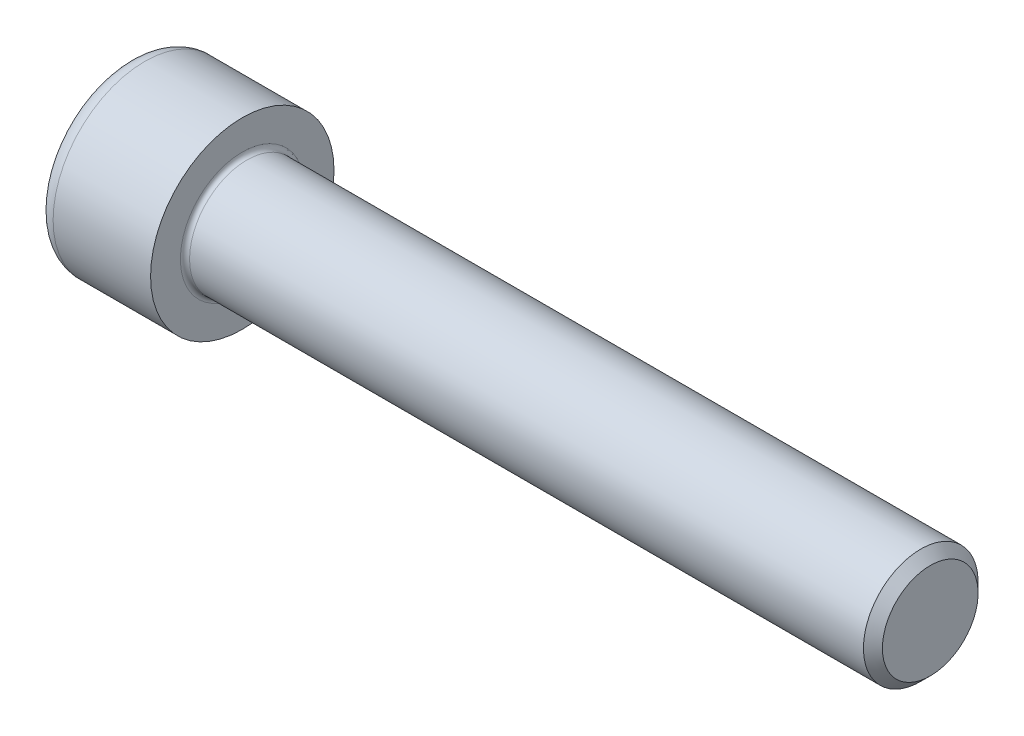
ISO-10303-21;
HEADER;
FILE_DESCRIPTION(('STEP AP214'),'2;1');
FILE_NAME('part.step','',(''),(''),'','','');
FILE_SCHEMA(('AUTOMOTIVE_DESIGN { 1 0 10303 214 1 1 1 1 }'));
ENDSEC;
DATA;
#1=APPLICATION_CONTEXT('core data for automotive mechanical design processes');
#2=APPLICATION_PROTOCOL_DEFINITION('international standard','automotive_design',2000,#1);
#3=PRODUCT_CONTEXT('',#1,'mechanical');
#4=PRODUCT('Part','Part','',(#3));
#5=PRODUCT_RELATED_PRODUCT_CATEGORY('part','',(#4));
#6=PRODUCT_DEFINITION_FORMATION('','',#4);
#7=PRODUCT_DEFINITION_CONTEXT('part definition',#1,'design');
#8=PRODUCT_DEFINITION('design','',#6,#7);
#9=PRODUCT_DEFINITION_SHAPE('','',#8);
#10=(LENGTH_UNIT() NAMED_UNIT(*) SI_UNIT(.MILLI.,.METRE.));
#11=(NAMED_UNIT(*) PLANE_ANGLE_UNIT() SI_UNIT($,.RADIAN.));
#12=(NAMED_UNIT(*) SI_UNIT($,.STERADIAN.) SOLID_ANGLE_UNIT());
#13=UNCERTAINTY_MEASURE_WITH_UNIT(LENGTH_MEASURE(1.E-05),#10,'distance_accuracy_value','');
#14=(GEOMETRIC_REPRESENTATION_CONTEXT(3) GLOBAL_UNCERTAINTY_ASSIGNED_CONTEXT((#13)) GLOBAL_UNIT_ASSIGNED_CONTEXT((#10,
#11,#12)) REPRESENTATION_CONTEXT('',''));
#15=CARTESIAN_POINT('',(0.,0.,0.));
#16=DIRECTION('',(0.,0.,1.));
#17=DIRECTION('',(1.,0.,0.));
#18=AXIS2_PLACEMENT_3D('',#15,#16,#17);
#19=CARTESIAN_POINT('',(0.,0.,0.));
#20=DIRECTION('',(-1.,0.,0.));
#21=DIRECTION('',(0.,0.,1.));
#22=AXIS2_PLACEMENT_3D('',#19,#20,#21);
#23=PLANE('',#22);
#24=DIRECTION('',(0.,-0.499999999999999,0.866025403784439));
#25=VECTOR('',#24,1.);
#26=CARTESIAN_POINT('',(0.,4.68519743447381,0.));
#27=LINE('',#26,#25);
#28=CARTESIAN_POINT('',(0.,4.68519743447381,0.));
#29=VERTEX_POINT('',#28);
#30=CARTESIAN_POINT('',(0.,2.34259871723691,4.0575));
#31=VERTEX_POINT('',#30);
#32=EDGE_CURVE('E263',#29,#31,#27,.T.);
#33=ORIENTED_EDGE('',*,*,#32,.T.);
#34=DIRECTION('',(0.,1.,0.));
#35=VECTOR('',#34,1.);
#36=CARTESIAN_POINT('',(0.,-2.3425987172369,4.0575));
#37=LINE('',#36,#35);
#38=CARTESIAN_POINT('',(0.,-2.3425987172369,4.0575));
#39=VERTEX_POINT('',#38);
#40=EDGE_CURVE('E135',#39,#31,#37,.T.);
#41=ORIENTED_EDGE('',*,*,#40,.F.);
#42=DIRECTION('',(0.,-0.500000000000001,-0.866025403784438));
#43=VECTOR('',#42,1.);
#44=CARTESIAN_POINT('',(0.,-2.3425987172369,4.0575));
#45=LINE('',#44,#43);
#46=CARTESIAN_POINT('',(0.,-4.68519743447381,0.));
#47=VERTEX_POINT('',#46);
#48=EDGE_CURVE('E266',#39,#47,#45,.T.);
#49=ORIENTED_EDGE('',*,*,#48,.T.);
#50=DIRECTION('',(0.,0.499999999999999,-0.866025403784439));
#51=VECTOR('',#50,1.);
#52=CARTESIAN_POINT('',(0.,-4.68519743447381,0.));
#53=LINE('',#52,#51);
#54=CARTESIAN_POINT('',(0.,-2.34259871723691,-4.0575));
#55=VERTEX_POINT('',#54);
#56=EDGE_CURVE('E269',#47,#55,#53,.T.);
#57=ORIENTED_EDGE('',*,*,#56,.T.);
#58=DIRECTION('',(0.,-1.,0.));
#59=VECTOR('',#58,1.);
#60=CARTESIAN_POINT('',(0.,2.3425987172369,-4.0575));
#61=LINE('',#60,#59);
#62=CARTESIAN_POINT('',(0.,2.3425987172369,-4.0575));
#63=VERTEX_POINT('',#62);
#64=EDGE_CURVE('E272',#63,#55,#61,.T.);
#65=ORIENTED_EDGE('',*,*,#64,.F.);
#66=DIRECTION('',(0.,-0.500000000000001,-0.866025403784438));
#67=VECTOR('',#66,1.);
#68=CARTESIAN_POINT('',(0.,4.68519743447381,0.));
#69=LINE('',#68,#67);
#70=EDGE_CURVE('E130',#29,#63,#69,.T.);
#71=ORIENTED_EDGE('',*,*,#70,.F.);
#72=EDGE_LOOP('',(#33,#41,#49,#57,#65,#71));
#73=FACE_BOUND('',#72,.T.);
#74=CARTESIAN_POINT('',(0.,0.,0.));
#75=DIRECTION('',(-1.,0.,0.));
#76=DIRECTION('',(0.,0.,1.));
#77=AXIS2_PLACEMENT_3D('',#74,#75,#76);
#78=CIRCLE('',#77,6.5);
#79=CARTESIAN_POINT('',(0.,0.,6.5));
#80=VERTEX_POINT('',#79);
#81=EDGE_CURVE('E47',#80,#80,#78,.T.);
#82=ORIENTED_EDGE('',*,*,#81,.T.);
#83=EDGE_LOOP('',(#82));
#84=FACE_BOUND('',#83,.T.);
#85=ADVANCED_FACE('F39',(#73,#84),#23,.T.);
#86=CARTESIAN_POINT('',(-31.75,0.,0.));
#87=DIRECTION('',(-1.,0.,0.));
#88=DIRECTION('',(0.,0.,1.));
#89=AXIS2_PLACEMENT_3D('',#86,#87,#88);
#90=CYLINDRICAL_SURFACE('',#89,8.);
#91=CARTESIAN_POINT('',(1.5,0.,0.));
#92=DIRECTION('',(-1.,0.,0.));
#93=DIRECTION('',(0.,0.,1.));
#94=AXIS2_PLACEMENT_3D('',#91,#92,#93);
#95=CIRCLE('',#94,8.);
#96=CARTESIAN_POINT('',(1.5,0.,8.));
#97=VERTEX_POINT('',#96);
#98=EDGE_CURVE('E11',#97,#97,#95,.F.);
#99=ORIENTED_EDGE('',*,*,#98,.T.);
#100=EDGE_LOOP('',(#99));
#101=FACE_BOUND('',#100,.T.);
#102=CARTESIAN_POINT('',(10.,0.,0.));
#103=DIRECTION('',(-1.,0.,0.));
#104=DIRECTION('',(0.,0.,1.));
#105=AXIS2_PLACEMENT_3D('',#102,#103,#104);
#106=CIRCLE('',#105,8.);
#107=CARTESIAN_POINT('',(10.,0.,8.));
#108=VERTEX_POINT('',#107);
#109=EDGE_CURVE('E153',#108,#108,#106,.T.);
#110=ORIENTED_EDGE('',*,*,#109,.T.);
#111=EDGE_LOOP('',(#110));
#112=FACE_BOUND('',#111,.T.);
#113=ADVANCED_FACE('F177',(#101,#112),#90,.T.);
#114=CARTESIAN_POINT('',(10.,8.,0.));
#115=DIRECTION('',(1.,0.,0.));
#116=DIRECTION('',(0.,0.,-1.));
#117=AXIS2_PLACEMENT_3D('',#114,#115,#116);
#118=PLANE('',#117);
#119=CARTESIAN_POINT('',(10.,0.,0.));
#120=DIRECTION('',(1.,0.,0.));
#121=DIRECTION('',(0.,0.,-1.));
#122=AXIS2_PLACEMENT_3D('',#119,#120,#121);
#123=CIRCLE('',#122,5.4);
#124=CARTESIAN_POINT('',(10.,0.,-5.4));
#125=VERTEX_POINT('',#124);
#126=EDGE_CURVE('E156',#125,#125,#123,.F.);
#127=ORIENTED_EDGE('',*,*,#126,.T.);
#128=EDGE_LOOP('',(#127));
#129=FACE_BOUND('',#128,.T.);
#130=ORIENTED_EDGE('',*,*,#109,.F.);
#131=EDGE_LOOP('',(#130));
#132=FACE_BOUND('',#131,.T.);
#133=ADVANCED_FACE('F183',(#129,#132),#118,.T.);
#134=CARTESIAN_POINT('',(-31.75,0.,0.));
#135=DIRECTION('',(-1.,0.,0.));
#136=DIRECTION('',(0.,0.,1.));
#137=AXIS2_PLACEMENT_3D('',#134,#135,#136);
#138=CYLINDRICAL_SURFACE('',#137,5.);
#139=CARTESIAN_POINT('',(10.4,0.,0.));
#140=DIRECTION('',(1.,0.,0.));
#141=DIRECTION('',(0.,0.,-1.));
#142=AXIS2_PLACEMENT_3D('',#139,#140,#141);
#143=CIRCLE('',#142,5.);
#144=CARTESIAN_POINT('',(10.4,0.,-5.));
#145=VERTEX_POINT('',#144);
#146=EDGE_CURVE('E159',#145,#145,#143,.T.);
#147=ORIENTED_EDGE('',*,*,#146,.T.);
#148=EDGE_LOOP('',(#147));
#149=FACE_BOUND('',#148,.T.);
#150=CARTESIAN_POINT('',(69.172,0.,0.));
#151=DIRECTION('',(-1.,0.,0.));
#152=DIRECTION('',(0.,0.,1.));
#153=AXIS2_PLACEMENT_3D('',#150,#151,#152);
#154=CIRCLE('',#153,5.);
#155=CARTESIAN_POINT('',(69.172,0.,5.));
#156=VERTEX_POINT('',#155);
#157=EDGE_CURVE('E150',#156,#156,#154,.T.);
#158=ORIENTED_EDGE('',*,*,#157,.T.);
#159=EDGE_LOOP('',(#158));
#160=FACE_BOUND('',#159,.T.);
#161=ADVANCED_FACE('F189',(#149,#160),#138,.T.);
#162=CARTESIAN_POINT('',(70.,0.,0.));
#163=DIRECTION('',(-1.,0.,0.));
#164=DIRECTION('',(0.,0.,1.));
#165=AXIS2_PLACEMENT_3D('',#162,#163,#164);
#166=CONICAL_SURFACE('',#165,4.172,0.785398163397469);
#167=ORIENTED_EDGE('',*,*,#157,.F.);
#168=EDGE_LOOP('',(#167));
#169=FACE_BOUND('',#168,.T.);
#170=CARTESIAN_POINT('',(70.,0.,0.));
#171=DIRECTION('',(-1.,0.,0.));
#172=DIRECTION('',(0.,0.,1.));
#173=AXIS2_PLACEMENT_3D('',#170,#171,#172);
#174=CIRCLE('',#173,4.172);
#175=CARTESIAN_POINT('',(70.,0.,4.172));
#176=VERTEX_POINT('',#175);
#177=EDGE_CURVE('E146',#176,#176,#174,.T.);
#178=ORIENTED_EDGE('',*,*,#177,.T.);
#179=EDGE_LOOP('',(#178));
#180=FACE_BOUND('',#179,.T.);
#181=ADVANCED_FACE('F193',(#169,#180),#166,.T.);
#182=CARTESIAN_POINT('',(70.,4.172,0.));
#183=DIRECTION('',(1.,0.,0.));
#184=DIRECTION('',(0.,0.,-1.));
#185=AXIS2_PLACEMENT_3D('',#182,#183,#184);
#186=PLANE('',#185);
#187=ORIENTED_EDGE('',*,*,#177,.F.);
#188=EDGE_LOOP('',(#187));
#189=FACE_BOUND('',#188,.T.);
#190=ADVANCED_FACE('F173',(#189),#186,.T.);
#191=CARTESIAN_POINT('',(10.4,0.,0.));
#192=DIRECTION('',(1.,0.,0.));
#193=DIRECTION('',(0.,0.,-1.));
#194=AXIS2_PLACEMENT_3D('',#191,#192,#193);
#195=TOROIDAL_SURFACE('',#194,5.4,0.4);
#196=ORIENTED_EDGE('',*,*,#146,.F.);
#197=EDGE_LOOP('',(#196));
#198=FACE_BOUND('',#197,.T.);
#199=ORIENTED_EDGE('',*,*,#126,.F.);
#200=EDGE_LOOP('',(#199));
#201=FACE_BOUND('',#200,.T.);
#202=ADVANCED_FACE('F166',(#198,#201),#195,.F.);
#203=CARTESIAN_POINT('',(1.5,0.,0.));
#204=DIRECTION('',(-1.,0.,0.));
#205=DIRECTION('',(0.,0.,1.));
#206=AXIS2_PLACEMENT_3D('',#203,#204,#205);
#207=TOROIDAL_SURFACE('',#206,6.5,1.5);
#208=ORIENTED_EDGE('',*,*,#98,.F.);
#209=EDGE_LOOP('',(#208));
#210=FACE_BOUND('',#209,.T.);
#211=ORIENTED_EDGE('',*,*,#81,.F.);
#212=EDGE_LOOP('',(#211));
#213=FACE_BOUND('',#212,.T.);
#214=ADVANCED_FACE('F41',(#210,#213),#207,.T.);
#215=CARTESIAN_POINT('',(5.,4.68519743447381,0.));
#216=DIRECTION('',(0.,-0.866025403784439,-0.499999999999999));
#217=DIRECTION('',(0.,0.499999999999999,-0.866025403784439));
#218=AXIS2_PLACEMENT_3D('',#215,#216,#217);
#219=PLANE('',#218);
#220=ORIENTED_EDGE('',*,*,#32,.F.);
#221=DIRECTION('',(-1.,0.,0.));
#222=VECTOR('',#221,1.);
#223=CARTESIAN_POINT('',(5.,4.68519743447381,0.));
#224=LINE('',#223,#222);
#225=CARTESIAN_POINT('',(5.,4.68519743447381,0.));
#226=VERTEX_POINT('',#225);
#227=EDGE_CURVE('E253',#226,#29,#224,.T.);
#228=ORIENTED_EDGE('',*,*,#227,.F.);
#229=DIRECTION('',(0.,-0.499999999999999,0.866025403784439));
#230=VECTOR('',#229,1.);
#231=CARTESIAN_POINT('',(5.,4.68519743447381,0.));
#232=LINE('',#231,#230);
#233=CARTESIAN_POINT('',(5.,3.51389807585536,2.02875));
#234=VERTEX_POINT('',#233);
#235=EDGE_CURVE('E122',#226,#234,#232,.T.);
#236=ORIENTED_EDGE('',*,*,#235,.T.);
#237=CARTESIAN_POINT('',(5.,2.34259871723691,4.0575));
#238=VERTEX_POINT('',#237);
#239=EDGE_CURVE('E113',#234,#238,#232,.T.);
#240=ORIENTED_EDGE('',*,*,#239,.T.);
#241=DIRECTION('',(-1.,0.,0.));
#242=VECTOR('',#241,1.);
#243=CARTESIAN_POINT('',(5.,2.34259871723691,4.0575));
#244=LINE('',#243,#242);
#245=EDGE_CURVE('E127',#238,#31,#244,.T.);
#246=ORIENTED_EDGE('',*,*,#245,.T.);
#247=EDGE_LOOP('',(#220,#228,#236,#240,#246));
#248=FACE_BOUND('',#247,.T.);
#249=ADVANCED_FACE('F126',(#248),#219,.T.);
#250=CARTESIAN_POINT('',(5.,-2.3425987172369,4.0575));
#251=DIRECTION('',(0.,0.,1.));
#252=DIRECTION('',(0.,-1.,0.));
#253=AXIS2_PLACEMENT_3D('',#250,#251,#252);
#254=PLANE('',#253);
#255=ORIENTED_EDGE('',*,*,#40,.T.);
#256=ORIENTED_EDGE('',*,*,#245,.F.);
#257=DIRECTION('',(0.,1.,0.));
#258=VECTOR('',#257,1.);
#259=CARTESIAN_POINT('',(5.,-2.3425987172369,4.0575));
#260=LINE('',#259,#258);
#261=CARTESIAN_POINT('',(5.,0.,4.0575));
#262=VERTEX_POINT('',#261);
#263=EDGE_CURVE('E110',#262,#238,#260,.T.);
#264=ORIENTED_EDGE('',*,*,#263,.F.);
#265=CARTESIAN_POINT('',(5.,-2.3425987172369,4.0575));
#266=VERTEX_POINT('',#265);
#267=EDGE_CURVE('E121',#266,#262,#260,.T.);
#268=ORIENTED_EDGE('',*,*,#267,.F.);
#269=DIRECTION('',(-1.,0.,0.));
#270=VECTOR('',#269,1.);
#271=CARTESIAN_POINT('',(5.,-2.3425987172369,4.0575));
#272=LINE('',#271,#270);
#273=EDGE_CURVE('E137',#266,#39,#272,.T.);
#274=ORIENTED_EDGE('',*,*,#273,.T.);
#275=EDGE_LOOP('',(#255,#256,#264,#268,#274));
#276=FACE_BOUND('',#275,.T.);
#277=ADVANCED_FACE('F132',(#276),#254,.F.);
#278=CARTESIAN_POINT('',(5.,-2.3425987172369,4.0575));
#279=DIRECTION('',(0.,0.866025403784438,-0.500000000000001));
#280=DIRECTION('',(0.,0.500000000000001,0.866025403784438));
#281=AXIS2_PLACEMENT_3D('',#278,#279,#280);
#282=PLANE('',#281);
#283=ORIENTED_EDGE('',*,*,#48,.F.);
#284=ORIENTED_EDGE('',*,*,#273,.F.);
#285=DIRECTION('',(0.,-0.500000000000001,-0.866025403784438));
#286=VECTOR('',#285,1.);
#287=CARTESIAN_POINT('',(5.,-2.3425987172369,4.0575));
#288=LINE('',#287,#286);
#289=CARTESIAN_POINT('',(5.,-3.51389807585536,2.02875));
#290=VERTEX_POINT('',#289);
#291=EDGE_CURVE('E292',#266,#290,#288,.T.);
#292=ORIENTED_EDGE('',*,*,#291,.T.);
#293=CARTESIAN_POINT('',(5.,-4.68519743447381,0.));
#294=VERTEX_POINT('',#293);
#295=EDGE_CURVE('E281',#290,#294,#288,.T.);
#296=ORIENTED_EDGE('',*,*,#295,.T.);
#297=DIRECTION('',(-1.,0.,0.));
#298=VECTOR('',#297,1.);
#299=CARTESIAN_POINT('',(5.,-4.68519743447381,0.));
#300=LINE('',#299,#298);
#301=EDGE_CURVE('E142',#294,#47,#300,.T.);
#302=ORIENTED_EDGE('',*,*,#301,.T.);
#303=EDGE_LOOP('',(#283,#284,#292,#296,#302));
#304=FACE_BOUND('',#303,.T.);
#305=ADVANCED_FACE('F207',(#304),#282,.T.);
#306=CARTESIAN_POINT('',(5.,-4.68519743447381,0.));
#307=DIRECTION('',(0.,0.866025403784439,0.499999999999999));
#308=DIRECTION('',(0.,-0.499999999999999,0.866025403784439));
#309=AXIS2_PLACEMENT_3D('',#306,#307,#308);
#310=PLANE('',#309);
#311=ORIENTED_EDGE('',*,*,#56,.F.);
#312=ORIENTED_EDGE('',*,*,#301,.F.);
#313=DIRECTION('',(0.,0.499999999999999,-0.866025403784439));
#314=VECTOR('',#313,1.);
#315=CARTESIAN_POINT('',(5.,-4.68519743447381,0.));
#316=LINE('',#315,#314);
#317=CARTESIAN_POINT('',(5.,-3.51389807585536,-2.02875));
#318=VERTEX_POINT('',#317);
#319=EDGE_CURVE('E259',#294,#318,#316,.T.);
#320=ORIENTED_EDGE('',*,*,#319,.T.);
#321=CARTESIAN_POINT('',(5.,-2.34259871723691,-4.0575));
#322=VERTEX_POINT('',#321);
#323=EDGE_CURVE('E291',#318,#322,#316,.T.);
#324=ORIENTED_EDGE('',*,*,#323,.T.);
#325=DIRECTION('',(-1.,0.,0.));
#326=VECTOR('',#325,1.);
#327=CARTESIAN_POINT('',(5.,-2.34259871723691,-4.0575));
#328=LINE('',#327,#326);
#329=EDGE_CURVE('E252',#322,#55,#328,.T.);
#330=ORIENTED_EDGE('',*,*,#329,.T.);
#331=EDGE_LOOP('',(#311,#312,#320,#324,#330));
#332=FACE_BOUND('',#331,.T.);
#333=ADVANCED_FACE('F210',(#332),#310,.T.);
#334=CARTESIAN_POINT('',(5.,2.3425987172369,-4.0575));
#335=DIRECTION('',(0.,0.,-1.));
#336=DIRECTION('',(0.,1.,0.));
#337=AXIS2_PLACEMENT_3D('',#334,#335,#336);
#338=PLANE('',#337);
#339=ORIENTED_EDGE('',*,*,#64,.T.);
#340=ORIENTED_EDGE('',*,*,#329,.F.);
#341=DIRECTION('',(0.,-1.,0.));
#342=VECTOR('',#341,1.);
#343=CARTESIAN_POINT('',(5.,2.3425987172369,-4.0575));
#344=LINE('',#343,#342);
#345=CARTESIAN_POINT('',(5.,0.,-4.0575));
#346=VERTEX_POINT('',#345);
#347=EDGE_CURVE('E256',#346,#322,#344,.T.);
#348=ORIENTED_EDGE('',*,*,#347,.F.);
#349=CARTESIAN_POINT('',(5.,2.3425987172369,-4.0575));
#350=VERTEX_POINT('',#349);
#351=EDGE_CURVE('E54',#350,#346,#344,.T.);
#352=ORIENTED_EDGE('',*,*,#351,.F.);
#353=DIRECTION('',(-1.,0.,0.));
#354=VECTOR('',#353,1.);
#355=CARTESIAN_POINT('',(5.,2.3425987172369,-4.0575));
#356=LINE('',#355,#354);
#357=EDGE_CURVE('E249',#350,#63,#356,.T.);
#358=ORIENTED_EDGE('',*,*,#357,.T.);
#359=EDGE_LOOP('',(#339,#340,#348,#352,#358));
#360=FACE_BOUND('',#359,.T.);
#361=ADVANCED_FACE('F214',(#360),#338,.F.);
#362=CARTESIAN_POINT('',(5.,4.68519743447381,0.));
#363=DIRECTION('',(0.,0.866025403784438,-0.500000000000001));
#364=DIRECTION('',(0.,0.500000000000001,0.866025403784438));
#365=AXIS2_PLACEMENT_3D('',#362,#363,#364);
#366=PLANE('',#365);
#367=ORIENTED_EDGE('',*,*,#70,.T.);
#368=ORIENTED_EDGE('',*,*,#357,.F.);
#369=DIRECTION('',(0.,-0.500000000000001,-0.866025403784438));
#370=VECTOR('',#369,1.);
#371=CARTESIAN_POINT('',(5.,4.68519743447381,0.));
#372=LINE('',#371,#370);
#373=CARTESIAN_POINT('',(5.,3.51389807585536,-2.02875));
#374=VERTEX_POINT('',#373);
#375=EDGE_CURVE('E239',#374,#350,#372,.T.);
#376=ORIENTED_EDGE('',*,*,#375,.F.);
#377=EDGE_CURVE('E245',#226,#374,#372,.T.);
#378=ORIENTED_EDGE('',*,*,#377,.F.);
#379=ORIENTED_EDGE('',*,*,#227,.T.);
#380=EDGE_LOOP('',(#367,#368,#376,#378,#379));
#381=FACE_BOUND('',#380,.T.);
#382=ADVANCED_FACE('F218',(#381),#366,.F.);
#383=CARTESIAN_POINT('',(5.,4.68519743447381,0.));
#384=DIRECTION('',(1.,0.,0.));
#385=DIRECTION('',(0.,0.,-1.));
#386=AXIS2_PLACEMENT_3D('',#383,#384,#385);
#387=PLANE('',#386);
#388=ORIENTED_EDGE('',*,*,#347,.T.);
#389=ORIENTED_EDGE('',*,*,#323,.F.);
#390=CARTESIAN_POINT('',(5.,0.,0.));
#391=DIRECTION('',(-1.,0.,0.));
#392=DIRECTION('',(0.,0.,1.));
#393=AXIS2_PLACEMENT_3D('',#390,#391,#392);
#394=CIRCLE('',#393,4.0575);
#395=EDGE_CURVE('E287',#346,#318,#394,.T.);
#396=ORIENTED_EDGE('',*,*,#395,.F.);
#397=EDGE_LOOP('',(#388,#389,#396));
#398=FACE_BOUND('',#397,.T.);
#399=ADVANCED_FACE('F222',(#398),#387,.F.);
#400=ORIENTED_EDGE('',*,*,#319,.F.);
#401=ORIENTED_EDGE('',*,*,#295,.F.);
#402=EDGE_CURVE('E140',#318,#290,#394,.T.);
#403=ORIENTED_EDGE('',*,*,#402,.F.);
#404=EDGE_LOOP('',(#400,#401,#403));
#405=FACE_BOUND('',#404,.T.);
#406=ADVANCED_FACE('F225',(#405),#387,.F.);
#407=ORIENTED_EDGE('',*,*,#291,.F.);
#408=ORIENTED_EDGE('',*,*,#267,.T.);
#409=EDGE_CURVE('E136',#290,#262,#394,.T.);
#410=ORIENTED_EDGE('',*,*,#409,.F.);
#411=EDGE_LOOP('',(#407,#408,#410));
#412=FACE_BOUND('',#411,.T.);
#413=ADVANCED_FACE('F230',(#412),#387,.F.);
#414=ORIENTED_EDGE('',*,*,#263,.T.);
#415=ORIENTED_EDGE('',*,*,#239,.F.);
#416=EDGE_CURVE('E116',#262,#234,#394,.T.);
#417=ORIENTED_EDGE('',*,*,#416,.F.);
#418=EDGE_LOOP('',(#414,#415,#417));
#419=FACE_BOUND('',#418,.T.);
#420=ADVANCED_FACE('F112',(#419),#387,.F.);
#421=ORIENTED_EDGE('',*,*,#235,.F.);
#422=ORIENTED_EDGE('',*,*,#377,.T.);
#423=EDGE_CURVE('E147',#234,#374,#394,.T.);
#424=ORIENTED_EDGE('',*,*,#423,.F.);
#425=EDGE_LOOP('',(#421,#422,#424));
#426=FACE_BOUND('',#425,.T.);
#427=ADVANCED_FACE('F233',(#426),#387,.F.);
#428=ORIENTED_EDGE('',*,*,#375,.T.);
#429=ORIENTED_EDGE('',*,*,#351,.T.);
#430=EDGE_CURVE('E242',#374,#346,#394,.T.);
#431=ORIENTED_EDGE('',*,*,#430,.F.);
#432=EDGE_LOOP('',(#428,#429,#431));
#433=FACE_BOUND('',#432,.T.);
#434=ADVANCED_FACE('F203',(#433),#387,.F.);
#435=CARTESIAN_POINT('',(5.,0.,0.));
#436=DIRECTION('',(-1.,0.,0.));
#437=DIRECTION('',(0.,0.,1.));
#438=AXIS2_PLACEMENT_3D('',#435,#436,#437);
#439=CONICAL_SURFACE('',#438,4.0575,1.04719755119659);
#440=CARTESIAN_POINT('',(7.34259871723693,0.,0.));
#441=VERTEX_POINT('',#440);
#442=VERTEX_LOOP('',#441);
#443=FACE_BOUND('',#442,.T.);
#444=ORIENTED_EDGE('',*,*,#416,.T.);
#445=ORIENTED_EDGE('',*,*,#423,.T.);
#446=ORIENTED_EDGE('',*,*,#430,.T.);
#447=ORIENTED_EDGE('',*,*,#395,.T.);
#448=ORIENTED_EDGE('',*,*,#402,.T.);
#449=ORIENTED_EDGE('',*,*,#409,.T.);
#450=EDGE_LOOP('',(#444,#445,#446,#447,#448,#449));
#451=FACE_BOUND('',#450,.T.);
#452=ADVANCED_FACE('F201',(#443,#451),#439,.F.);
#453=CLOSED_SHELL('',(#85,#113,#133,#161,#181,#190,#202,#214,#249,#277,#305,#333,#361,#382,#399,
#406,#413,#420,#427,#434,#452));
#454=MANIFOLD_SOLID_BREP('B2',#453);
#455=ADVANCED_BREP_SHAPE_REPRESENTATION('',(#18,#454),#14);
#456=SHAPE_DEFINITION_REPRESENTATION(#9,#455);
ENDSEC;
END-ISO-10303-21;
